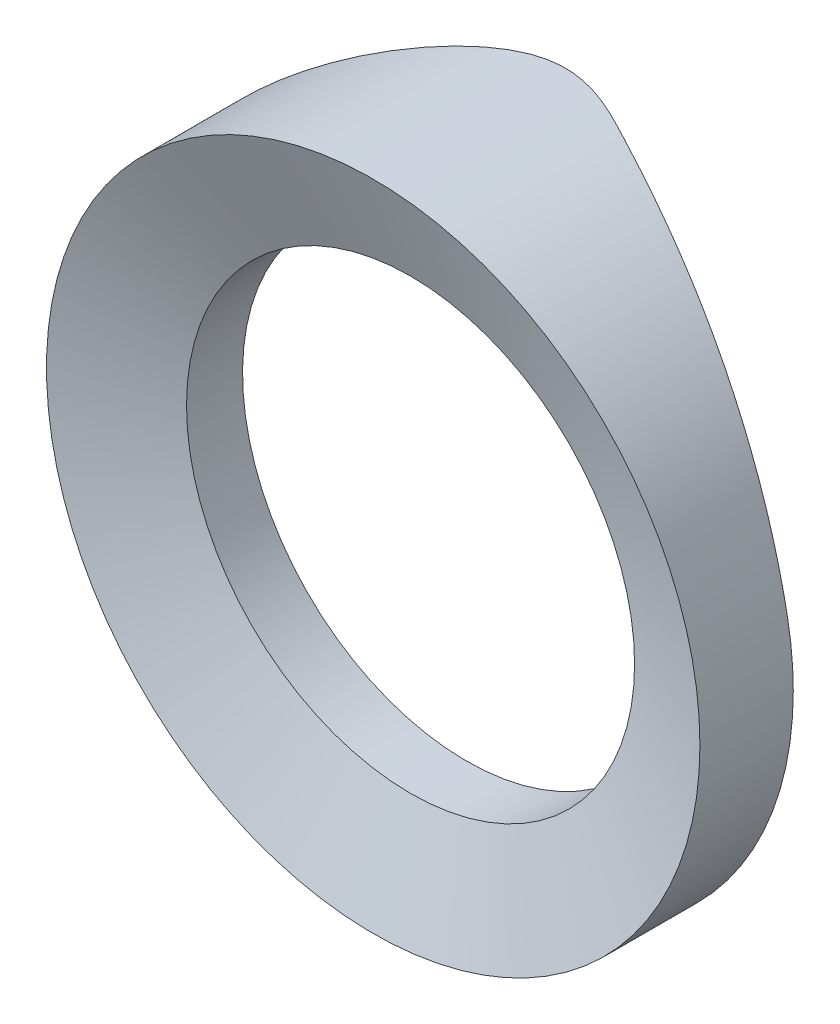
ISO-10303-21;
HEADER;
FILE_DESCRIPTION(('STEP AP214'),'2;1');
FILE_NAME('part.step','',(''),(''),'','','');
FILE_SCHEMA(('AUTOMOTIVE_DESIGN { 1 0 10303 214 1 1 1 1 }'));
ENDSEC;
DATA;
#1=APPLICATION_CONTEXT('core data for automotive mechanical design processes');
#2=APPLICATION_PROTOCOL_DEFINITION('international standard','automotive_design',2000,#1);
#3=PRODUCT_CONTEXT('',#1,'mechanical');
#4=PRODUCT('Part','Part','',(#3));
#5=PRODUCT_RELATED_PRODUCT_CATEGORY('part','',(#4));
#6=PRODUCT_DEFINITION_FORMATION('','',#4);
#7=PRODUCT_DEFINITION_CONTEXT('part definition',#1,'design');
#8=PRODUCT_DEFINITION('design','',#6,#7);
#9=PRODUCT_DEFINITION_SHAPE('','',#8);
#10=(LENGTH_UNIT() NAMED_UNIT(*) SI_UNIT(.MILLI.,.METRE.));
#11=(NAMED_UNIT(*) PLANE_ANGLE_UNIT() SI_UNIT($,.RADIAN.));
#12=(NAMED_UNIT(*) SI_UNIT($,.STERADIAN.) SOLID_ANGLE_UNIT());
#13=UNCERTAINTY_MEASURE_WITH_UNIT(LENGTH_MEASURE(1.E-05),#10,'distance_accuracy_value','');
#14=(GEOMETRIC_REPRESENTATION_CONTEXT(3) GLOBAL_UNCERTAINTY_ASSIGNED_CONTEXT((#13)) GLOBAL_UNIT_ASSIGNED_CONTEXT((#10,
#11,#12)) REPRESENTATION_CONTEXT('',''));
#15=CARTESIAN_POINT('',(0.,0.,0.));
#16=DIRECTION('',(0.,0.,1.));
#17=DIRECTION('',(1.,0.,0.));
#18=AXIS2_PLACEMENT_3D('',#15,#16,#17);
#19=CARTESIAN_POINT('',(14.3572,7.02929999999999,16.477));
#20=DIRECTION('',(0.,0.,1.));
#21=DIRECTION('',(1.,0.,0.));
#22=AXIS2_PLACEMENT_3D('',#19,#20,#21);
#23=CYLINDRICAL_SURFACE('',#22,12.);
#24=CARTESIAN_POINT('',(14.3572,7.02929999999999,15.));
#25=DIRECTION('',(0.,0.,1.));
#26=DIRECTION('',(1.,0.,0.));
#27=AXIS2_PLACEMENT_3D('',#24,#25,#26);
#28=CIRCLE('',#27,12.);
#29=CARTESIAN_POINT('',(7.67998939151986,17.,15.));
#30=VERTEX_POINT('',#29);
#31=CARTESIAN_POINT('',(21.5676974131419,16.6214179650312,15.));
#32=VERTEX_POINT('',#31);
#33=EDGE_CURVE('E51',#30,#32,#28,.T.);
#34=ORIENTED_EDGE('',*,*,#33,.F.);
#35=CARTESIAN_POINT('',(18.,18.4630224104838,14.8650852141869));
#36=CARTESIAN_POINT('',(17.8379706380212,18.5146468255018,14.8554743716205));
#37=CARTESIAN_POINT('',(17.6748360845289,18.562826193006,14.8459940778321));
#38=CARTESIAN_POINT('',(17.3466291682845,18.6522184368649,14.827661782648));
#39=CARTESIAN_POINT('',(17.1815567451553,18.6934310955424,14.8188098008891));
#40=CARTESIAN_POINT('',(16.8497277334087,18.7688168987728,14.8021005062617));
#41=CARTESIAN_POINT('',(16.6829708545723,18.8029888077822,14.7942433680661));
#42=CARTESIAN_POINT('',(16.3481142846517,18.8642161787162,14.7798250659604));
#43=CARTESIAN_POINT('',(16.1800146104237,18.8912717298283,14.7732638858087));
#44=CARTESIAN_POINT('',(15.6755139204375,18.9614818412555,14.755965061755));
#45=CARTESIAN_POINT('',(15.3374821039773,18.9940042263514,14.7475358109718));
#46=CARTESIAN_POINT('',(14.6598606707239,19.0302807801113,14.7381069005912));
#47=CARTESIAN_POINT('',(14.3202712693662,19.0340388139581,14.7371062427841));
#48=CARTESIAN_POINT('',(13.6497594391455,19.0130162060108,14.7426013128141));
#49=CARTESIAN_POINT('',(13.3188153750457,18.9888819511959,14.7489272581764));
#50=CARTESIAN_POINT('',(12.6602407711296,18.9133313236855,14.7679258880126));
#51=CARTESIAN_POINT('',(12.3326103324607,18.8619141207315,14.7805987656318));
#52=CARTESIAN_POINT('',(11.6828237812027,18.7321850160083,14.8105029076844));
#53=CARTESIAN_POINT('',(11.3606695775047,18.6538639300398,14.8277357282869));
#54=CARTESIAN_POINT('',(10.7240253959207,18.4708803351589,14.8641721632179));
#55=CARTESIAN_POINT('',(10.4095360454404,18.3662156777857,14.8833759382127));
#56=CARTESIAN_POINT('',(9.7881123397805,18.1304088975353,14.9206383067494));
#57=CARTESIAN_POINT('',(9.48124374087845,17.9990919058404,14.9386882440575));
#58=CARTESIAN_POINT('',(8.8793723908423,17.7112784515278,14.9696313809969));
#59=CARTESIAN_POINT('',(8.58436655764705,17.5547885825939,14.9825259279363));
#60=CARTESIAN_POINT('',(8.00767490642608,17.217295517444,14.9988346577039));
#61=CARTESIAN_POINT('',(7.72601184297377,17.03625234495,15.0022331805519));
#62=CARTESIAN_POINT('',(7.31560799791349,16.7475321725217,14.9965950242641));
#63=CARTESIAN_POINT('',(7.18073957049916,16.6483640469883,14.9929205311038));
#64=CARTESIAN_POINT('',(6.91535209251953,16.4445486900223,14.9813460465965));
#65=CARTESIAN_POINT('',(6.78483399826266,16.3399002667183,14.9734451326033));
#66=CARTESIAN_POINT('',(6.65664577472147,16.2326398624382,14.9631123575698));
#67=B_SPLINE_CURVE_WITH_KNOTS('',3,(#35,#36,#37,#38,#39,#40,#41,#42,#43,#44,#45,#46,#47,#48,#49,
#50,#51,#52,#53,#54,#55,#56,#57,#58,#59,#60,#61,#62,#63,#64,#65,#66),.UNSPECIFIED.,.F.,.F.,(4,2,
2,2,2,2,2,2,2,2,2,2,2,2,2,4),(0.,0.510938882158517,1.02189372582264,1.53293815799029,
2.04397618506548,3.06166461128585,4.07921628417579,5.07365175995532,6.06811749953819,
7.06292305858036,8.05780977570538,9.05944829131581,10.0608248676449,11.0638518513607,
11.5660072181114,12.0682722523479),.UNSPECIFIED.);
#68=CARTESIAN_POINT('',(18.,18.4630224104838,14.8650852141869));
#69=VERTEX_POINT('',#68);
#70=EDGE_CURVE('E72',#69,#30,#67,.T.);
#71=ORIENTED_EDGE('',*,*,#70,.F.);
#72=CARTESIAN_POINT('',(21.5676974131419,16.6214179650312,15.));
#73=CARTESIAN_POINT('',(21.2948760534684,16.826549783006,14.9999870121865));
#74=CARTESIAN_POINT('',(21.0132868412395,17.0199552587077,14.9961517479416));
#75=CARTESIAN_POINT('',(20.4369043113632,17.3807103575588,14.9823194483063));
#76=CARTESIAN_POINT('',(20.1422232896992,17.5482410880197,14.9723679211904));
#77=CARTESIAN_POINT('',(19.5398803933489,17.8577118140646,14.947742190132));
#78=CARTESIAN_POINT('',(19.2322171642168,17.9996491312768,14.9330674923527));
#79=CARTESIAN_POINT('',(18.6038419899047,18.2579450663039,14.9001678478143));
#80=CARTESIAN_POINT('',(18.2830502744083,18.3741064420001,14.8819174102518));
#81=CARTESIAN_POINT('',(17.9579495004039,18.4763346830671,14.8625882895838));
#82=B_SPLINE_CURVE_WITH_KNOTS('',3,(#72,#73,#74,#75,#76,#77,#78,#79,#80,#81),.UNSPECIFIED.,.F.,
.F.,(4,2,2,2,4),(0.,1.02362134353346,2.0397170839069,3.05591909790206,4.07964788134222),.UNSPECIFIED.);
#83=EDGE_CURVE('E78',#32,#69,#82,.T.);
#84=ORIENTED_EDGE('',*,*,#83,.F.);
#85=EDGE_LOOP('',(#34,#71,#84));
#86=FACE_BOUND('',#85,.T.);
#87=CARTESIAN_POINT('',(14.3572,7.02929999999999,18.));
#88=DIRECTION('',(0.,0.,1.));
#89=DIRECTION('',(1.,0.,0.));
#90=AXIS2_PLACEMENT_3D('',#87,#88,#89);
#91=CIRCLE('',#90,12.);
#92=CARTESIAN_POINT('',(26.3572,7.02929999999999,18.));
#93=VERTEX_POINT('',#92);
#94=EDGE_CURVE('E115',#93,#93,#91,.T.);
#95=ORIENTED_EDGE('',*,*,#94,.T.);
#96=EDGE_LOOP('',(#95));
#97=FACE_BOUND('',#96,.T.);
#98=ADVANCED_FACE('F37',(#86,#97),#23,.F.);
#99=CARTESIAN_POINT('',(14.3572,7.02929999999999,18.));
#100=DIRECTION('',(0.,0.,1.));
#101=DIRECTION('',(1.,0.,0.));
#102=AXIS2_PLACEMENT_3D('',#99,#100,#101);
#103=CONICAL_SURFACE('',#102,12.,1.22202532321099);
#104=CARTESIAN_POINT('',(14.3572,7.02929999999999,20.));
#105=DIRECTION('',(0.,0.,1.));
#106=DIRECTION('',(1.,0.,0.));
#107=AXIS2_PLACEMENT_3D('',#104,#105,#106);
#108=CIRCLE('',#107,17.5);
#109=CARTESIAN_POINT('',(31.8572,7.02929999999999,20.));
#110=VERTEX_POINT('',#109);
#111=EDGE_CURVE('E133',#110,#110,#108,.T.);
#112=ORIENTED_EDGE('',*,*,#111,.T.);
#113=EDGE_LOOP('',(#112));
#114=FACE_BOUND('',#113,.T.);
#115=ORIENTED_EDGE('',*,*,#94,.F.);
#116=EDGE_LOOP('',(#115));
#117=FACE_BOUND('',#116,.T.);
#118=ADVANCED_FACE('F122',(#114,#117),#103,.F.);
#119=CARTESIAN_POINT('',(14.3572,7.02929999999999,16.477));
#120=DIRECTION('',(0.,0.,1.));
#121=DIRECTION('',(1.,0.,0.));
#122=AXIS2_PLACEMENT_3D('',#119,#120,#121);
#123=CYLINDRICAL_SURFACE('',#122,17.5);
#124=CARTESIAN_POINT('',(14.3572,7.02929999999999,15.));
#125=DIRECTION('',(0.,0.,1.));
#126=DIRECTION('',(1.,0.,0.));
#127=AXIS2_PLACEMENT_3D('',#124,#125,#126);
#128=CIRCLE('',#127,17.5);
#129=CARTESIAN_POINT('',(31.5569341661861,10.2571699807353,15.));
#130=VERTEX_POINT('',#129);
#131=CARTESIAN_POINT('',(-0.0245642001946225,17.,15.));
#132=VERTEX_POINT('',#131);
#133=EDGE_CURVE('E11',#130,#132,#128,.F.);
#134=ORIENTED_EDGE('',*,*,#133,.F.);
#135=CARTESIAN_POINT('',(17.9998,24.1460013539408,10.5964794782729));
#136=CARTESIAN_POINT('',(18.2390342240603,24.0950989452197,10.6976071997531));
#137=CARTESIAN_POINT('',(18.4780155497793,24.0389900387913,10.7967014009636));
#138=CARTESIAN_POINT('',(18.954820212913,23.9163484156852,10.9911584614104));
#139=CARTESIAN_POINT('',(19.1926435458204,23.8498156584689,11.0865213061335));
#140=CARTESIAN_POINT('',(19.6665183548106,23.7063037420313,11.273866461416));
#141=CARTESIAN_POINT('',(19.9025695234446,23.629322812446,11.3658481957078));
#142=CARTESIAN_POINT('',(20.3722524051209,23.4649646305994,11.5465906303003));
#143=CARTESIAN_POINT('',(20.6058841227215,23.3775873979284,11.6353513366701));
#144=CARTESIAN_POINT('',(21.3031473377448,23.0995938652235,11.8973156658704));
#145=CARTESIAN_POINT('',(21.7623993006903,22.8933412364755,12.0659082452645));
#146=CARTESIAN_POINT('',(22.6646439539853,22.4400543973146,12.3910499232725));
#147=CARTESIAN_POINT('',(23.1076378540604,22.1930232286912,12.5475999189017));
#148=CARTESIAN_POINT('',(23.9714455678314,21.6605160848511,12.8478286409658));
#149=CARTESIAN_POINT('',(24.3923522955757,21.3752227665803,12.99156342645));
#150=CARTESIAN_POINT('',(25.2103105043755,20.7668328114308,13.2664802025909));
#151=CARTESIAN_POINT('',(25.6073612595843,20.4437350251867,13.3976618113741));
#152=CARTESIAN_POINT('',(26.3734747856667,19.7620054310437,13.6466350328388));
#153=CARTESIAN_POINT('',(26.7425659114568,19.4034104973812,13.7644402731894));
#154=CARTESIAN_POINT('',(27.4496194816701,18.6527404498729,13.9859517454193));
#155=CARTESIAN_POINT('',(27.7875838506453,18.2606674088544,14.0896588491683));
#156=CARTESIAN_POINT('',(28.4122391854665,17.4670869650438,14.2769782362974));
#157=CARTESIAN_POINT('',(28.7006862692376,17.0671420909921,14.3613572000922));
#158=CARTESIAN_POINT('',(29.24389089416,16.242347316979,14.5156867229619));
#159=CARTESIAN_POINT('',(29.498649312705,15.8174980660478,14.5856376578296));
#160=CARTESIAN_POINT('',(29.9720161216251,14.9459556158319,14.7101763436377));
#161=CARTESIAN_POINT('',(30.1906246235058,14.4992624839309,14.7647641419667));
#162=CARTESIAN_POINT('',(30.5895222798585,13.5874477071478,14.8576270183874));
#163=CARTESIAN_POINT('',(30.7698133114681,13.1223269663424,14.8959028956777));
#164=CARTESIAN_POINT('',(31.0808448072799,12.2052240055728,14.9534686218581));
#165=CARTESIAN_POINT('',(31.2138769412753,11.754079483335,14.9737432495338));
#166=CARTESIAN_POINT('',(31.4432564618388,10.8421343008329,14.9982926413259));
#167=CARTESIAN_POINT('',(31.5396054121809,10.3813340530681,15.0025680875428));
#168=CARTESIAN_POINT('',(31.6948180303289,9.45376848316631,14.9944654944751));
#169=CARTESIAN_POINT('',(31.7536946460426,8.98700527835283,14.9820932121276));
#170=CARTESIAN_POINT('',(31.8336606854677,8.05102192285784,14.9401618173583));
#171=CARTESIAN_POINT('',(31.8547509466744,7.58180182686195,14.9106030858753));
#172=CARTESIAN_POINT('',(31.8591573840383,6.66323993875767,14.835436383739));
#173=CARTESIAN_POINT('',(31.8439396159838,6.21384834974861,14.7905119842687));
#174=CARTESIAN_POINT('',(31.7792433188854,5.31950433424881,14.6842920424396));
#175=CARTESIAN_POINT('',(31.7297659659328,4.87455175590392,14.6229970621079));
#176=CARTESIAN_POINT('',(31.597436844734,3.99233546359443,14.4840977015643));
#177=CARTESIAN_POINT('',(31.5145924915164,3.55507006385264,14.4064969467573));
#178=CARTESIAN_POINT('',(31.3167497281372,2.69108770715949,14.2352854448404));
#179=CARTESIAN_POINT('',(31.2017510586698,2.26437083530607,14.1416745686205));
#180=CARTESIAN_POINT('',(30.9404214160809,1.42195685178339,13.9385294671691));
#181=CARTESIAN_POINT('',(30.793928174716,1.00632984107673,13.8289137567104));
#182=CARTESIAN_POINT('',(30.471707289649,0.190813408420098,13.5951406792257));
#183=CARTESIAN_POINT('',(30.2959791043445,-0.209075721802396,13.4709830428107));
#184=CARTESIAN_POINT('',(29.9169845746488,-0.991435861218734,13.2095229200278));
#185=CARTESIAN_POINT('',(29.71369935145,-1.37389468710266,13.0722114412939));
#186=CARTESIAN_POINT('',(29.2814155960367,-2.11966478898284,12.786563544632));
#187=CARTESIAN_POINT('',(29.0524182723482,-2.48297696373591,12.6382276449871));
#188=CARTESIAN_POINT('',(28.6801511387581,-3.02839545048712,12.4029367306835));
#189=CARTESIAN_POINT('',(28.5453849289546,-3.21761209909245,12.3188235364278));
#190=CARTESIAN_POINT('',(28.2688447974809,-3.59001825875041,12.1488031410977));
#191=CARTESIAN_POINT('',(28.1270712759982,-3.77320811300043,12.0628960426346));
#192=CARTESIAN_POINT('',(27.8365625772052,-4.13360229601516,11.8899654354404));
#193=CARTESIAN_POINT('',(27.6878239601962,-4.31080359136249,11.8029413908401));
#194=CARTESIAN_POINT('',(27.3834929082953,-4.65912074667886,11.6287103486487));
#195=CARTESIAN_POINT('',(27.2279005983395,-4.83023671747469,11.5415033544202));
#196=CARTESIAN_POINT('',(26.9097388399936,-5.16649318000348,11.367973083925));
#197=CARTESIAN_POINT('',(26.7471662093003,-5.33163088165393,11.2816502334317));
#198=CARTESIAN_POINT('',(26.4149447330816,-5.65591512286207,11.1113235265223));
#199=CARTESIAN_POINT('',(26.2452953161882,-5.81506117668277,11.0273198582666));
#200=CARTESIAN_POINT('',(25.8988020499235,-6.12728652450415,10.8634909957987));
#201=CARTESIAN_POINT('',(25.7219637629951,-6.28037033472821,10.7836626762689));
#202=CARTESIAN_POINT('',(25.3606624379909,-6.58058494815886,10.6304219676513));
#203=CARTESIAN_POINT('',(25.1762011569591,-6.72771710787597,10.5570081120922));
#204=CARTESIAN_POINT('',(24.795191012647,-7.01908361985495,10.4179837696024));
#205=CARTESIAN_POINT('',(24.5984675420374,-7.16318767619595,10.3525749683374));
#206=CARTESIAN_POINT('',(24.1964395511789,-7.4447997539515,10.2351773854775));
#207=CARTESIAN_POINT('',(23.9911364645906,-7.58230886920363,10.1831863720961));
#208=CARTESIAN_POINT('',(23.5737026357822,-7.84910553496992,10.0969734627679));
#209=CARTESIAN_POINT('',(23.3616322649343,-7.97844551456445,10.0626253353393));
#210=CARTESIAN_POINT('',(22.9304015656516,-8.22888894883123,10.0145433464038));
#211=CARTESIAN_POINT('',(22.7112431059562,-8.34999454875244,10.0008040960043));
#212=CARTESIAN_POINT('',(22.266408783277,-8.58344701059571,9.99549740033404));
#213=CARTESIAN_POINT('',(22.0407024478234,-8.69573888520902,10.004059261172));
#214=CARTESIAN_POINT('',(21.5861493919213,-8.90981719312733,10.0426171651501));
#215=CARTESIAN_POINT('',(21.3573017871371,-9.01160059637571,10.0726193708438));
#216=CARTESIAN_POINT('',(20.8963739298457,-9.20499139117261,10.1512288368934));
#217=CARTESIAN_POINT('',(20.6642825052692,-9.29650973679662,10.199984741209));
#218=CARTESIAN_POINT('',(20.1995855786615,-9.46851628595466,10.3119802045754));
#219=CARTESIAN_POINT('',(19.9669800727387,-9.5490044056995,10.3752198736399));
#220=CARTESIAN_POINT('',(19.5891023346642,-9.67101324300388,10.4864825401491));
#221=CARTESIAN_POINT('',(19.4439030169966,-9.71580036371152,10.5312770619897));
#222=CARTESIAN_POINT('',(19.1533941888475,-9.80131024412105,10.6241578899406));
#223=CARTESIAN_POINT('',(19.0080847071223,-9.84203383667746,10.6722435180905));
#224=CARTESIAN_POINT('',(18.7190838352888,-9.91903509237124,10.7703749772251));
#225=CARTESIAN_POINT('',(18.5753946110955,-9.95536142768996,10.8203892873236));
#226=CARTESIAN_POINT('',(18.2877842919674,-10.0242142342304,10.9223466376375));
#227=CARTESIAN_POINT('',(18.1438631912065,-10.0567406084164,10.9742897270615));
#228=CARTESIAN_POINT('',(17.9998,-10.0874013539408,11.0269069999085));
#229=B_SPLINE_CURVE_WITH_KNOTS('',3,(#135,#136,#137,#138,#139,#140,#141,#142,#143,#144,#145,
#146,#147,#148,#149,#150,#151,#152,#153,#154,#155,#156,#157,#158,#159,#160,#161,#162,#163,#164,
#165,#166,#167,#168,#169,#170,#171,#172,#173,#174,#175,#176,#177,#178,#179,#180,#181,#182,#183,
#184,#185,#186,#187,#188,#189,#190,#191,#192,#193,#194,#195,#196,#197,#198,#199,#200,#201,#202,
#203,#204,#205,#206,#207,#208,#209,#210,#211,#212,#213,#214,#215,#216,#217,#218,#219,#220,#221,
#222,#223,#224,#225,#226,#227,#228),.UNSPECIFIED.,.F.,.F.,(4,2,2,2,2,2,2,2,2,2,2,2,2,2,2,2,2,2,
2,2,2,2,2,2,2,2,2,2,2,2,2,2,2,2,2,2,2,2,2,2,2,2,2,2,2,2,4),(0.,0.793947635323004,
1.58789835840394,2.38198377878414,3.1760677028488,4.76672992350365,6.35727354561962,
7.9404778697554,9.52373034041196,11.1053550605605,12.6868819238969,14.1857991301902,
15.6846772907214,17.1835508278207,18.6823509195423,20.0929453091867,21.5034795596181,
22.9135261597055,24.3235415071896,25.6775923394231,27.0315966909841,28.3853003128977,
29.7390148519572,31.0998787863506,32.4607679347234,33.8225941592792,35.1843564017439,
35.9253922905776,36.6663859076286,37.4077494037108,38.1490993910545,38.8907910223956,
39.6325426530394,40.3737308824258,41.1147492159466,41.8716979349408,42.6285206690619,
43.3798502930601,44.1309834220801,44.8864814464551,45.6421967094348,46.4040295732808,
47.1658682239368,47.6410348701916,48.116103926107,48.5853091633025,49.0545263794921),.UNSPECIFIED.);
#230=CARTESIAN_POINT('',(18.,24.1459587907804,10.5965640492654));
#231=VERTEX_POINT('',#230);
#232=EDGE_CURVE('E110',#231,#130,#229,.T.);
#233=ORIENTED_EDGE('',*,*,#232,.F.);
#234=CARTESIAN_POINT('',(-0.024564200194626,17.,15.));
#235=CARTESIAN_POINT('',(0.0732521136302816,17.1410968112023,14.9999985713313));
#236=CARTESIAN_POINT('',(0.173126640914747,17.2807143162135,14.9962673110403));
#237=CARTESIAN_POINT('',(0.3767283841531,17.5566827223427,14.9818041057337));
#238=CARTESIAN_POINT('',(0.480454487323934,17.6930345485262,14.9710741681351));
#239=CARTESIAN_POINT('',(0.796629127499936,18.0962484874705,14.9291335700656));
#240=CARTESIAN_POINT('',(1.01451308559751,18.3579017111889,14.8881679633409));
#241=CARTESIAN_POINT('',(1.4602499712116,18.8627677983662,14.7843332623295));
#242=CARTESIAN_POINT('',(1.68797142479932,19.1061478944652,14.7217030081745));
#243=CARTESIAN_POINT('',(2.15400596278777,19.5768829305719,14.5776179683264));
#244=CARTESIAN_POINT('',(2.39232577373681,19.8042274494686,14.4961510856422));
#245=CARTESIAN_POINT('',(2.96121209959346,20.3174242003119,14.2866755502394));
#246=CARTESIAN_POINT('',(3.29541614063136,20.5966456150995,14.1522829897203));
#247=CARTESIAN_POINT('',(3.97731509348975,21.1251942639104,13.8610388468252));
#248=CARTESIAN_POINT('',(4.32501325394403,21.374514239495,13.7041818314983));
#249=CARTESIAN_POINT('',(5.03399987674327,21.8451729466554,13.3724144699727));
#250=CARTESIAN_POINT('',(5.39535796871883,22.0663328199418,13.1974004100821));
#251=CARTESIAN_POINT('',(6.12823389245019,22.4795779097884,12.8352122280414));
#252=CARTESIAN_POINT('',(6.49974962264508,22.6716690875607,12.6480406103646));
#253=CARTESIAN_POINT('',(7.26986033052777,23.0358428741571,12.2576596396067));
#254=CARTESIAN_POINT('',(7.6689135094654,23.2065916953718,12.0541088293006));
#255=CARTESIAN_POINT('',(8.27581813518136,23.4400822348908,11.7478294239133));
#256=CARTESIAN_POINT('',(8.47960070820171,23.5141685294777,11.645531186464));
#257=CARTESIAN_POINT('',(8.89011261331176,23.6548238597219,11.4416927825185));
#258=CARTESIAN_POINT('',(9.09684172212692,23.7213934615839,11.3401525594627));
#259=CARTESIAN_POINT('',(9.51307811253241,23.8468988797838,11.1393193006291));
#260=CARTESIAN_POINT('',(9.72257823269133,23.9058512654744,11.0400217886646));
#261=CARTESIAN_POINT('',(10.1452009928806,24.0162586069592,10.8450816813554));
#262=CARTESIAN_POINT('',(10.3583231271418,24.0677146000804,10.7494385816786));
#263=CARTESIAN_POINT('',(10.7885441072842,24.16298583121,10.5640534202003));
#264=CARTESIAN_POINT('',(11.0056384549129,24.2068091845001,10.4743051548598));
#265=CARTESIAN_POINT('',(11.4446015748509,24.2866612214646,10.3035496384395));
#266=CARTESIAN_POINT('',(11.6664684467287,24.3226929468485,10.2225389825689));
#267=CARTESIAN_POINT('',(12.0998078088052,24.3843749743797,10.0784279625557));
#268=CARTESIAN_POINT('',(12.3109106221509,24.4105780159499,10.014467644677));
#269=CARTESIAN_POINT('',(12.7379053177017,24.45554262998,9.90148172767748));
#270=CARTESIAN_POINT('',(12.9537960838248,24.4743059178052,9.85245268649505));
#271=CARTESIAN_POINT('',(13.3877927501343,24.503769618692,9.77402514087965));
#272=CARTESIAN_POINT('',(13.6058622082184,24.514539827716,9.74445696686952));
#273=CARTESIAN_POINT('',(14.044120180014,24.5278709307696,9.70768743237393));
#274=CARTESIAN_POINT('',(14.2643078466434,24.5304349799245,9.70047747557718));
#275=CARTESIAN_POINT('',(14.705165878172,24.5272355584697,9.70937999842065));
#276=CARTESIAN_POINT('',(14.9258336547519,24.5214329284419,9.72560215037459));
#277=CARTESIAN_POINT('',(15.3641885607234,24.5016835805324,9.77948370869642));
#278=CARTESIAN_POINT('',(15.5818739401181,24.4877322744605,9.8171551920154));
#279=CARTESIAN_POINT('',(16.0146703932509,24.4519979908371,9.91036253182636));
#280=CARTESIAN_POINT('',(16.2297407778514,24.4301457892955,9.96605581929342));
#281=CARTESIAN_POINT('',(16.6549556725333,24.3791179095735,10.0908170290233));
#282=CARTESIAN_POINT('',(16.8651009252542,24.3499433433704,10.1598829201534));
#283=CARTESIAN_POINT('',(17.2307286159828,24.2925080625794,10.2898455116325));
#284=CARTESIAN_POINT('',(17.3871845820642,24.2657201208227,10.3487023924895));
#285=CARTESIAN_POINT('',(17.6960976481266,24.2085353706346,10.4700898322892));
#286=CARTESIAN_POINT('',(17.8485793079356,24.1781784154404,10.5325764961032));
#287=CARTESIAN_POINT('',(18.,24.1459587907804,10.5965640492654));
#288=B_SPLINE_CURVE_WITH_KNOTS('',3,(#234,#235,#236,#237,#238,#239,#240,#241,#242,#243,#244,
#245,#246,#247,#248,#249,#250,#251,#252,#253,#254,#255,#256,#257,#258,#259,#260,#261,#262,#263,
#264,#265,#266,#267,#268,#269,#270,#271,#272,#273,#274,#275,#276,#277,#278,#279,#280,#281,#282,
#283,#284,#285,#286,#287),.UNSPECIFIED.,.F.,.F.,(4,2,2,2,2,2,2,2,2,2,2,2,2,2,2,2,2,2,2,2,2,2,2,
2,2,2,4),(0.,0.514926483759046,1.02970533706331,2.05696281968183,3.07323844810803,
4.09016855629706,5.45540534219169,6.82097286521144,8.19482171854304,9.56838844929533,
11.005391575013,11.7245404995244,12.4436352170273,13.161138401449,13.8785422055546,
14.5951785223105,15.3115345702191,15.9773961961837,16.6431042067075,17.3029285279209,
17.9624991276993,18.6251668216047,19.2882079971073,19.9572050857209,20.626100641566,
21.1338675222881,21.6364239379106),.UNSPECIFIED.);
#289=EDGE_CURVE('E44',#132,#231,#288,.T.);
#290=ORIENTED_EDGE('',*,*,#289,.F.);
#291=EDGE_LOOP('',(#134,#233,#290));
#292=FACE_BOUND('',#291,.T.);
#293=ORIENTED_EDGE('',*,*,#111,.F.);
#294=EDGE_LOOP('',(#293));
#295=FACE_BOUND('',#294,.T.);
#296=ADVANCED_FACE('F104',(#292,#295),#123,.T.);
#297=CARTESIAN_POINT('',(-18.,0.,15.));
#298=DIRECTION('',(0.,0.,1.));
#299=DIRECTION('',(1.,0.,0.));
#300=AXIS2_PLACEMENT_3D('',#297,#298,#299);
#301=PLANE('',#300);
#302=ORIENTED_EDGE('',*,*,#133,.T.);
#303=DIRECTION('',(-1.,0.,0.));
#304=VECTOR('',#303,1.);
#305=CARTESIAN_POINT('',(-18.,17.,15.));
#306=LINE('',#305,#304);
#307=EDGE_CURVE('E74',#30,#132,#306,.T.);
#308=ORIENTED_EDGE('',*,*,#307,.F.);
#309=ORIENTED_EDGE('',*,*,#33,.T.);
#310=CARTESIAN_POINT('',(18.,0.,15.));
#311=DIRECTION('',(0.,0.,1.));
#312=DIRECTION('',(1.,0.,0.));
#313=AXIS2_PLACEMENT_3D('',#310,#311,#312);
#314=CIRCLE('',#313,17.);
#315=EDGE_CURVE('E79',#130,#32,#314,.T.);
#316=ORIENTED_EDGE('',*,*,#315,.F.);
#317=EDGE_LOOP('',(#302,#308,#309,#316));
#318=FACE_BOUND('',#317,.T.);
#319=ADVANCED_FACE('F81',(#318),#301,.F.);
#320=CARTESIAN_POINT('',(-18.,17.,7.));
#321=DIRECTION('',(1.,0.,0.));
#322=DIRECTION('',(0.,0.,-1.));
#323=AXIS2_PLACEMENT_3D('',#320,#321,#322);
#324=CYLINDRICAL_SURFACE('',#323,8.);
#325=ORIENTED_EDGE('',*,*,#289,.T.);
#326=CARTESIAN_POINT('',(18.,17.,7.));
#327=DIRECTION('',(1.,0.,0.));
#328=DIRECTION('',(0.,0.,-1.));
#329=AXIS2_PLACEMENT_3D('',#326,#327,#328);
#330=CIRCLE('',#329,8.);
#331=EDGE_CURVE('E59',#231,#69,#330,.T.);
#332=ORIENTED_EDGE('',*,*,#331,.T.);
#333=ORIENTED_EDGE('',*,*,#70,.T.);
#334=ORIENTED_EDGE('',*,*,#307,.T.);
#335=EDGE_LOOP('',(#325,#332,#333,#334));
#336=FACE_BOUND('',#335,.T.);
#337=ADVANCED_FACE('F73',(#336),#324,.F.);
#338=CARTESIAN_POINT('',(18.,0.,7.));
#339=DIRECTION('',(0.,0.,1.));
#340=DIRECTION('',(1.,0.,0.));
#341=AXIS2_PLACEMENT_3D('',#338,#339,#340);
#342=TOROIDAL_SURFACE('',#341,17.,8.);
#343=ORIENTED_EDGE('',*,*,#232,.T.);
#344=ORIENTED_EDGE('',*,*,#315,.T.);
#345=ORIENTED_EDGE('',*,*,#83,.T.);
#346=ORIENTED_EDGE('',*,*,#331,.F.);
#347=EDGE_LOOP('',(#343,#344,#345,#346));
#348=FACE_BOUND('',#347,.T.);
#349=ADVANCED_FACE('F105',(#348),#342,.F.);
#350=CLOSED_SHELL('',(#98,#118,#296,#319,#337,#349));
#351=MANIFOLD_SOLID_BREP('B2',#350);
#352=ADVANCED_BREP_SHAPE_REPRESENTATION('',(#18,#351),#14);
#353=SHAPE_DEFINITION_REPRESENTATION(#9,#352);
ENDSEC;
END-ISO-10303-21;
